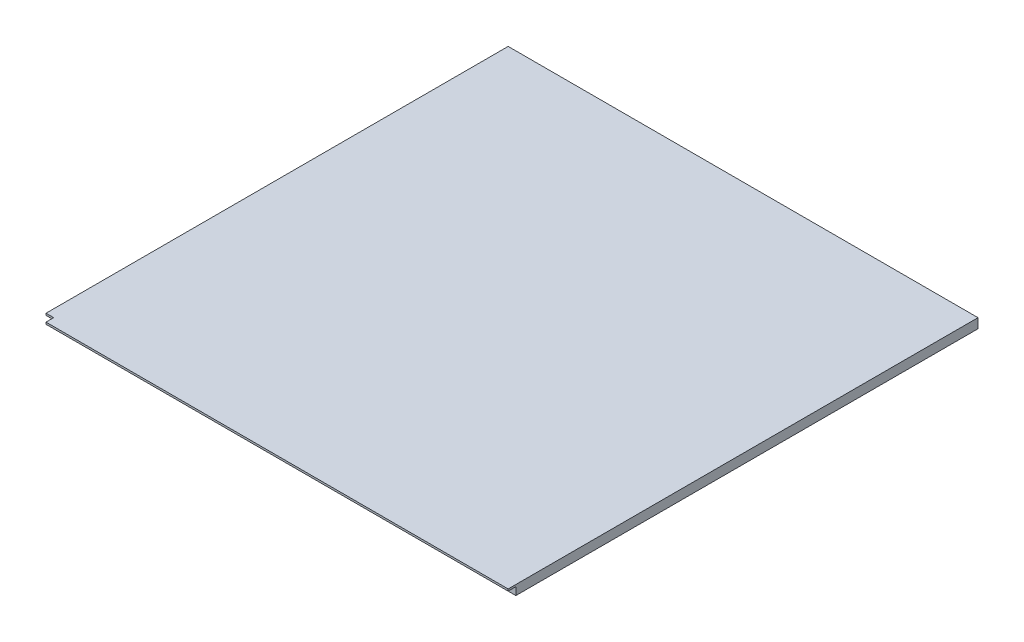
ISO-10303-21;
HEADER;
FILE_DESCRIPTION(('STEP AP214'),'2;1');
FILE_NAME('part.step','',(''),(''),'','','');
FILE_SCHEMA(('AUTOMOTIVE_DESIGN { 1 0 10303 214 1 1 1 1 }'));
ENDSEC;
DATA;
#1=APPLICATION_CONTEXT('core data for automotive mechanical design processes');
#2=APPLICATION_PROTOCOL_DEFINITION('international standard','automotive_design',2000,#1);
#3=PRODUCT_CONTEXT('',#1,'mechanical');
#4=PRODUCT('Part','Part','',(#3));
#5=PRODUCT_RELATED_PRODUCT_CATEGORY('part','',(#4));
#6=PRODUCT_DEFINITION_FORMATION('','',#4);
#7=PRODUCT_DEFINITION_CONTEXT('part definition',#1,'design');
#8=PRODUCT_DEFINITION('design','',#6,#7);
#9=PRODUCT_DEFINITION_SHAPE('','',#8);
#10=(LENGTH_UNIT() NAMED_UNIT(*) SI_UNIT(.MILLI.,.METRE.));
#11=(NAMED_UNIT(*) PLANE_ANGLE_UNIT() SI_UNIT($,.RADIAN.));
#12=(NAMED_UNIT(*) SI_UNIT($,.STERADIAN.) SOLID_ANGLE_UNIT());
#13=UNCERTAINTY_MEASURE_WITH_UNIT(LENGTH_MEASURE(1.E-05),#10,'distance_accuracy_value','');
#14=(GEOMETRIC_REPRESENTATION_CONTEXT(3) GLOBAL_UNCERTAINTY_ASSIGNED_CONTEXT((#13)) GLOBAL_UNIT_ASSIGNED_CONTEXT((#10,
#11,#12)) REPRESENTATION_CONTEXT('',''));
#15=CARTESIAN_POINT('',(0.,0.,0.));
#16=DIRECTION('',(0.,0.,1.));
#17=DIRECTION('',(1.,0.,0.));
#18=AXIS2_PLACEMENT_3D('',#15,#16,#17);
#19=CARTESIAN_POINT('',(0.,2.54,0.));
#20=DIRECTION('',(0.,1.,0.));
#21=DIRECTION('',(0.,0.,1.));
#22=AXIS2_PLACEMENT_3D('',#19,#20,#21);
#23=PLANE('',#22);
#24=DIRECTION('',(0.,0.,-1.));
#25=VECTOR('',#24,1.);
#26=CARTESIAN_POINT('',(0.,2.54,0.));
#27=LINE('',#26,#25);
#28=CARTESIAN_POINT('',(0.,2.54,0.));
#29=VERTEX_POINT('',#28);
#30=CARTESIAN_POINT('',(0.,2.54,-152.4));
#31=VERTEX_POINT('',#30);
#32=EDGE_CURVE('E136',#29,#31,#27,.T.);
#33=ORIENTED_EDGE('',*,*,#32,.F.);
#34=DIRECTION('',(-1.,0.,0.));
#35=VECTOR('',#34,1.);
#36=CARTESIAN_POINT('',(0.,2.54,0.));
#37=LINE('',#36,#35);
#38=CARTESIAN_POINT('',(-2.53999999999998,2.54,0.));
#39=VERTEX_POINT('',#38);
#40=EDGE_CURVE('E11',#29,#39,#37,.T.);
#41=ORIENTED_EDGE('',*,*,#40,.T.);
#42=DIRECTION('',(0.,0.,1.));
#43=VECTOR('',#42,1.);
#44=CARTESIAN_POINT('',(-2.54,2.54,-152.4));
#45=LINE('',#44,#43);
#46=CARTESIAN_POINT('',(-2.54,2.54,-152.4));
#47=VERTEX_POINT('',#46);
#48=EDGE_CURVE('E178',#47,#39,#45,.T.);
#49=ORIENTED_EDGE('',*,*,#48,.F.);
#50=DIRECTION('',(-1.,0.,0.));
#51=VECTOR('',#50,1.);
#52=CARTESIAN_POINT('',(0.,2.54,-152.4));
#53=LINE('',#52,#51);
#54=EDGE_CURVE('E143',#31,#47,#53,.T.);
#55=ORIENTED_EDGE('',*,*,#54,.F.);
#56=EDGE_LOOP('',(#33,#41,#49,#55));
#57=FACE_BOUND('',#56,.T.);
#58=ADVANCED_FACE('F38',(#57),#23,.F.);
#59=CARTESIAN_POINT('',(0.,3.175,0.));
#60=DIRECTION('',(1.,0.,0.));
#61=DIRECTION('',(0.,0.,-1.));
#62=AXIS2_PLACEMENT_3D('',#59,#60,#61);
#63=PLANE('',#62);
#64=ORIENTED_EDGE('',*,*,#32,.T.);
#65=DIRECTION('',(0.,-1.,0.));
#66=VECTOR('',#65,1.);
#67=CARTESIAN_POINT('',(0.,3.175,-152.4));
#68=LINE('',#67,#66);
#69=CARTESIAN_POINT('',(0.,0.,-152.4));
#70=VERTEX_POINT('',#69);
#71=EDGE_CURVE('E96',#31,#70,#68,.T.);
#72=ORIENTED_EDGE('',*,*,#71,.T.);
#73=DIRECTION('',(0.,0.,1.));
#74=VECTOR('',#73,1.);
#75=CARTESIAN_POINT('',(0.,0.,0.));
#76=LINE('',#75,#74);
#77=CARTESIAN_POINT('',(0.,0.,0.));
#78=VERTEX_POINT('',#77);
#79=EDGE_CURVE('E100',#70,#78,#76,.T.);
#80=ORIENTED_EDGE('',*,*,#79,.T.);
#81=DIRECTION('',(0.,-1.,0.));
#82=VECTOR('',#81,1.);
#83=CARTESIAN_POINT('',(0.,3.175,0.));
#84=LINE('',#83,#82);
#85=EDGE_CURVE('E111',#29,#78,#84,.T.);
#86=ORIENTED_EDGE('',*,*,#85,.F.);
#87=EDGE_LOOP('',(#64,#72,#80,#86));
#88=FACE_BOUND('',#87,.T.);
#89=ADVANCED_FACE('F40',(#88),#63,.F.);
#90=CARTESIAN_POINT('',(0.,3.175,0.));
#91=DIRECTION('',(0.,0.,-1.));
#92=DIRECTION('',(-1.,0.,0.));
#93=AXIS2_PLACEMENT_3D('',#90,#91,#92);
#94=PLANE('',#93);
#95=DIRECTION('',(-1.,0.,0.));
#96=VECTOR('',#95,1.);
#97=CARTESIAN_POINT('',(152.4,2.54,0.));
#98=LINE('',#97,#96);
#99=CARTESIAN_POINT('',(152.4,2.54,0.));
#100=VERTEX_POINT('',#99);
#101=EDGE_CURVE('E124',#100,#29,#98,.T.);
#102=ORIENTED_EDGE('',*,*,#101,.T.);
#103=ORIENTED_EDGE('',*,*,#85,.T.);
#104=DIRECTION('',(1.,0.,0.));
#105=VECTOR('',#104,1.);
#106=CARTESIAN_POINT('',(0.,0.,0.));
#107=LINE('',#106,#105);
#108=CARTESIAN_POINT('',(152.4,0.,0.));
#109=VERTEX_POINT('',#108);
#110=EDGE_CURVE('E86',#78,#109,#107,.T.);
#111=ORIENTED_EDGE('',*,*,#110,.T.);
#112=DIRECTION('',(0.,-1.,0.));
#113=VECTOR('',#112,1.);
#114=CARTESIAN_POINT('',(152.4,3.175,0.));
#115=LINE('',#114,#113);
#116=EDGE_CURVE('E79',#100,#109,#115,.T.);
#117=ORIENTED_EDGE('',*,*,#116,.F.);
#118=EDGE_LOOP('',(#102,#103,#111,#117));
#119=FACE_BOUND('',#118,.T.);
#120=ADVANCED_FACE('F150',(#119),#94,.F.);
#121=CARTESIAN_POINT('',(152.4,3.175,0.));
#122=DIRECTION('',(-1.,0.,0.));
#123=DIRECTION('',(0.,0.,1.));
#124=AXIS2_PLACEMENT_3D('',#121,#122,#123);
#125=PLANE('',#124);
#126=DIRECTION('',(0.,0.,-1.));
#127=VECTOR('',#126,1.);
#128=CARTESIAN_POINT('',(152.4,0.,0.));
#129=LINE('',#128,#127);
#130=CARTESIAN_POINT('',(152.4,0.,-152.4));
#131=VERTEX_POINT('',#130);
#132=EDGE_CURVE('E72',#109,#131,#129,.T.);
#133=ORIENTED_EDGE('',*,*,#132,.T.);
#134=DIRECTION('',(0.,-1.,0.));
#135=VECTOR('',#134,1.);
#136=CARTESIAN_POINT('',(152.4,3.175,-152.4));
#137=LINE('',#136,#135);
#138=CARTESIAN_POINT('',(152.4,3.175,-152.4));
#139=VERTEX_POINT('',#138);
#140=EDGE_CURVE('E75',#139,#131,#137,.T.);
#141=ORIENTED_EDGE('',*,*,#140,.F.);
#142=DIRECTION('',(0.,0.,-1.));
#143=VECTOR('',#142,1.);
#144=CARTESIAN_POINT('',(152.4,3.175,0.));
#145=LINE('',#144,#143);
#146=CARTESIAN_POINT('',(152.4,3.175,2.54));
#147=VERTEX_POINT('',#146);
#148=EDGE_CURVE('E55',#147,#139,#145,.T.);
#149=ORIENTED_EDGE('',*,*,#148,.F.);
#150=DIRECTION('',(0.,1.,0.));
#151=VECTOR('',#150,1.);
#152=CARTESIAN_POINT('',(152.4,2.54,2.54));
#153=LINE('',#152,#151);
#154=CARTESIAN_POINT('',(152.4,2.54,2.54));
#155=VERTEX_POINT('',#154);
#156=EDGE_CURVE('E156',#155,#147,#153,.T.);
#157=ORIENTED_EDGE('',*,*,#156,.F.);
#158=DIRECTION('',(0.,0.,-1.));
#159=VECTOR('',#158,1.);
#160=CARTESIAN_POINT('',(152.4,2.54,2.54));
#161=LINE('',#160,#159);
#162=EDGE_CURVE('E153',#155,#100,#161,.T.);
#163=ORIENTED_EDGE('',*,*,#162,.T.);
#164=ORIENTED_EDGE('',*,*,#116,.T.);
#165=EDGE_LOOP('',(#133,#141,#149,#157,#163,#164));
#166=FACE_BOUND('',#165,.T.);
#167=ADVANCED_FACE('F74',(#166),#125,.F.);
#168=CARTESIAN_POINT('',(0.,3.175,-152.4));
#169=DIRECTION('',(0.,0.,1.));
#170=DIRECTION('',(1.,0.,0.));
#171=AXIS2_PLACEMENT_3D('',#168,#169,#170);
#172=PLANE('',#171);
#173=DIRECTION('',(-1.,0.,0.));
#174=VECTOR('',#173,1.);
#175=CARTESIAN_POINT('',(0.,0.,-152.4));
#176=LINE('',#175,#174);
#177=EDGE_CURVE('E85',#131,#70,#176,.T.);
#178=ORIENTED_EDGE('',*,*,#177,.T.);
#179=ORIENTED_EDGE('',*,*,#71,.F.);
#180=ORIENTED_EDGE('',*,*,#54,.T.);
#181=DIRECTION('',(0.,1.,0.));
#182=VECTOR('',#181,1.);
#183=CARTESIAN_POINT('',(-2.54,2.54,-152.4));
#184=LINE('',#183,#182);
#185=CARTESIAN_POINT('',(-2.54,3.175,-152.4));
#186=VERTEX_POINT('',#185);
#187=EDGE_CURVE('E152',#47,#186,#184,.T.);
#188=ORIENTED_EDGE('',*,*,#187,.T.);
#189=DIRECTION('',(-1.,0.,0.));
#190=VECTOR('',#189,1.);
#191=CARTESIAN_POINT('',(0.,3.175,-152.4));
#192=LINE('',#191,#190);
#193=EDGE_CURVE('E94',#139,#186,#192,.T.);
#194=ORIENTED_EDGE('',*,*,#193,.F.);
#195=ORIENTED_EDGE('',*,*,#140,.T.);
#196=EDGE_LOOP('',(#178,#179,#180,#188,#194,#195));
#197=FACE_BOUND('',#196,.T.);
#198=ADVANCED_FACE('F90',(#197),#172,.F.);
#199=CARTESIAN_POINT('',(0.,3.175,0.));
#200=DIRECTION('',(0.,-1.,0.));
#201=DIRECTION('',(0.,0.,-1.));
#202=AXIS2_PLACEMENT_3D('',#199,#200,#201);
#203=PLANE('',#202);
#204=DIRECTION('',(0.,0.,1.));
#205=VECTOR('',#204,1.);
#206=CARTESIAN_POINT('',(-2.54,3.175,-152.4));
#207=LINE('',#206,#205);
#208=CARTESIAN_POINT('',(-2.53999999999998,3.175,0.));
#209=VERTEX_POINT('',#208);
#210=EDGE_CURVE('E169',#186,#209,#207,.T.);
#211=ORIENTED_EDGE('',*,*,#210,.T.);
#212=DIRECTION('',(-1.,0.,0.));
#213=VECTOR('',#212,1.);
#214=CARTESIAN_POINT('',(-2.53999999999998,3.175,0.));
#215=LINE('',#214,#213);
#216=CARTESIAN_POINT('',(0.,3.175,0.));
#217=VERTEX_POINT('',#216);
#218=EDGE_CURVE('E187',#217,#209,#215,.T.);
#219=ORIENTED_EDGE('',*,*,#218,.F.);
#220=DIRECTION('',(0.,0.,-1.));
#221=VECTOR('',#220,1.);
#222=CARTESIAN_POINT('',(0.,3.175,2.54));
#223=LINE('',#222,#221);
#224=CARTESIAN_POINT('',(0.,3.175,2.54));
#225=VERTEX_POINT('',#224);
#226=EDGE_CURVE('E197',#225,#217,#223,.T.);
#227=ORIENTED_EDGE('',*,*,#226,.F.);
#228=DIRECTION('',(1.,0.,0.));
#229=VECTOR('',#228,1.);
#230=CARTESIAN_POINT('',(-2.53999999999998,3.175,2.54));
#231=LINE('',#230,#229);
#232=EDGE_CURVE('E147',#225,#147,#231,.T.);
#233=ORIENTED_EDGE('',*,*,#232,.T.);
#234=ORIENTED_EDGE('',*,*,#148,.T.);
#235=ORIENTED_EDGE('',*,*,#193,.T.);
#236=EDGE_LOOP('',(#211,#219,#227,#233,#234,#235));
#237=FACE_BOUND('',#236,.T.);
#238=ADVANCED_FACE('F208',(#237),#203,.F.);
#239=CARTESIAN_POINT('',(0.,0.,0.));
#240=DIRECTION('',(0.,-1.,0.));
#241=DIRECTION('',(0.,0.,-1.));
#242=AXIS2_PLACEMENT_3D('',#239,#240,#241);
#243=PLANE('',#242);
#244=ORIENTED_EDGE('',*,*,#79,.F.);
#245=ORIENTED_EDGE('',*,*,#177,.F.);
#246=ORIENTED_EDGE('',*,*,#132,.F.);
#247=ORIENTED_EDGE('',*,*,#110,.F.);
#248=EDGE_LOOP('',(#244,#245,#246,#247));
#249=FACE_BOUND('',#248,.T.);
#250=ADVANCED_FACE('F98',(#249),#243,.T.);
#251=CARTESIAN_POINT('',(-2.53999999999998,2.54,2.54));
#252=DIRECTION('',(0.,0.,1.));
#253=DIRECTION('',(1.,0.,0.));
#254=AXIS2_PLACEMENT_3D('',#251,#252,#253);
#255=PLANE('',#254);
#256=DIRECTION('',(0.,1.,0.));
#257=VECTOR('',#256,1.);
#258=CARTESIAN_POINT('',(0.,0.,2.54));
#259=LINE('',#258,#257);
#260=CARTESIAN_POINT('',(0.,2.54,2.54));
#261=VERTEX_POINT('',#260);
#262=EDGE_CURVE('E183',#261,#225,#259,.T.);
#263=ORIENTED_EDGE('',*,*,#262,.F.);
#264=DIRECTION('',(1.,0.,0.));
#265=VECTOR('',#264,1.);
#266=CARTESIAN_POINT('',(-2.53999999999998,2.54,2.54));
#267=LINE('',#266,#265);
#268=EDGE_CURVE('E127',#261,#155,#267,.T.);
#269=ORIENTED_EDGE('',*,*,#268,.T.);
#270=ORIENTED_EDGE('',*,*,#156,.T.);
#271=ORIENTED_EDGE('',*,*,#232,.F.);
#272=EDGE_LOOP('',(#263,#269,#270,#271));
#273=FACE_BOUND('',#272,.T.);
#274=ADVANCED_FACE('F228',(#273),#255,.T.);
#275=CARTESIAN_POINT('',(-2.54,2.54,-152.4));
#276=DIRECTION('',(-1.,0.,0.));
#277=DIRECTION('',(0.,0.,1.));
#278=AXIS2_PLACEMENT_3D('',#275,#276,#277);
#279=PLANE('',#278);
#280=DIRECTION('',(0.,1.,0.));
#281=VECTOR('',#280,1.);
#282=CARTESIAN_POINT('',(-2.53999999999998,0.,0.));
#283=LINE('',#282,#281);
#284=EDGE_CURVE('E172',#39,#209,#283,.T.);
#285=ORIENTED_EDGE('',*,*,#284,.T.);
#286=ORIENTED_EDGE('',*,*,#210,.F.);
#287=ORIENTED_EDGE('',*,*,#187,.F.);
#288=ORIENTED_EDGE('',*,*,#48,.T.);
#289=EDGE_LOOP('',(#285,#286,#287,#288));
#290=FACE_BOUND('',#289,.T.);
#291=ADVANCED_FACE('F215',(#290),#279,.T.);
#292=ORIENTED_EDGE('',*,*,#268,.F.);
#293=DIRECTION('',(0.,0.,-1.));
#294=VECTOR('',#293,1.);
#295=CARTESIAN_POINT('',(0.,2.54,0.));
#296=LINE('',#295,#294);
#297=EDGE_CURVE('E48',#261,#29,#296,.T.);
#298=ORIENTED_EDGE('',*,*,#297,.T.);
#299=ORIENTED_EDGE('',*,*,#101,.F.);
#300=ORIENTED_EDGE('',*,*,#162,.F.);
#301=EDGE_LOOP('',(#292,#298,#299,#300));
#302=FACE_BOUND('',#301,.T.);
#303=ADVANCED_FACE('F120',(#302),#23,.F.);
#304=CARTESIAN_POINT('',(-2.53999999999998,0.,0.));
#305=DIRECTION('',(0.,0.,-1.));
#306=DIRECTION('',(-1.,0.,0.));
#307=AXIS2_PLACEMENT_3D('',#304,#305,#306);
#308=PLANE('',#307);
#309=DIRECTION('',(0.,1.,0.));
#310=VECTOR('',#309,1.);
#311=CARTESIAN_POINT('',(0.,0.,0.));
#312=LINE('',#311,#310);
#313=EDGE_CURVE('E186',#29,#217,#312,.T.);
#314=ORIENTED_EDGE('',*,*,#313,.T.);
#315=ORIENTED_EDGE('',*,*,#218,.T.);
#316=ORIENTED_EDGE('',*,*,#284,.F.);
#317=ORIENTED_EDGE('',*,*,#40,.F.);
#318=EDGE_LOOP('',(#314,#315,#316,#317));
#319=FACE_BOUND('',#318,.T.);
#320=ADVANCED_FACE('F212',(#319),#308,.F.);
#321=CARTESIAN_POINT('',(0.,0.,2.54));
#322=DIRECTION('',(1.,0.,0.));
#323=DIRECTION('',(0.,0.,-1.));
#324=AXIS2_PLACEMENT_3D('',#321,#322,#323);
#325=PLANE('',#324);
#326=ORIENTED_EDGE('',*,*,#262,.T.);
#327=ORIENTED_EDGE('',*,*,#226,.T.);
#328=ORIENTED_EDGE('',*,*,#313,.F.);
#329=ORIENTED_EDGE('',*,*,#297,.F.);
#330=EDGE_LOOP('',(#326,#327,#328,#329));
#331=FACE_BOUND('',#330,.T.);
#332=ADVANCED_FACE('F203',(#331),#325,.F.);
#333=CLOSED_SHELL('',(#58,#89,#120,#167,#198,#238,#250,#274,#291,#303,#320,#332));
#334=MANIFOLD_SOLID_BREP('B2',#333);
#335=ADVANCED_BREP_SHAPE_REPRESENTATION('',(#18,#334),#14);
#336=SHAPE_DEFINITION_REPRESENTATION(#9,#335);
ENDSEC;
END-ISO-10303-21;
